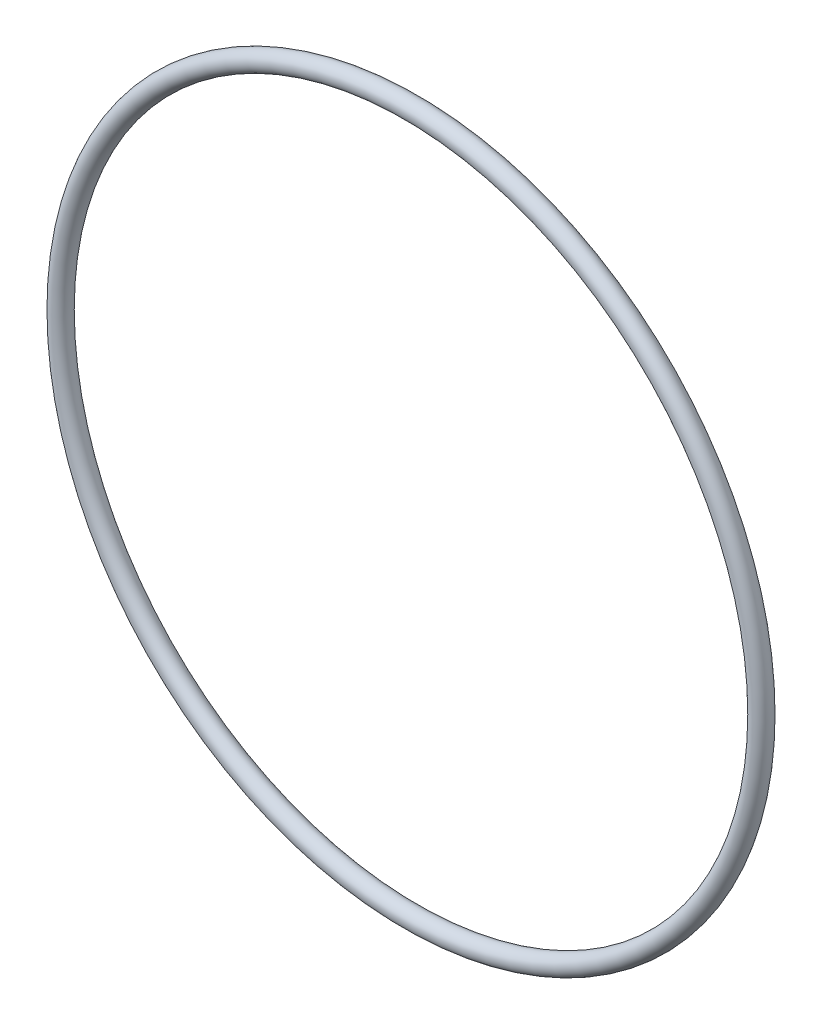
ISO-10303-21;
HEADER;
FILE_DESCRIPTION(('STEP AP214'),'2;1');
FILE_NAME('part.step','',(''),(''),'','','');
FILE_SCHEMA(('AUTOMOTIVE_DESIGN { 1 0 10303 214 1 1 1 1 }'));
ENDSEC;
DATA;
#1=APPLICATION_CONTEXT('core data for automotive mechanical design processes');
#2=APPLICATION_PROTOCOL_DEFINITION('international standard','automotive_design',2000,#1);
#3=PRODUCT_CONTEXT('',#1,'mechanical');
#4=PRODUCT('Part','Part','',(#3));
#5=PRODUCT_RELATED_PRODUCT_CATEGORY('part','',(#4));
#6=PRODUCT_DEFINITION_FORMATION('','',#4);
#7=PRODUCT_DEFINITION_CONTEXT('part definition',#1,'design');
#8=PRODUCT_DEFINITION('design','',#6,#7);
#9=PRODUCT_DEFINITION_SHAPE('','',#8);
#10=(LENGTH_UNIT() NAMED_UNIT(*) SI_UNIT(.MILLI.,.METRE.));
#11=(NAMED_UNIT(*) PLANE_ANGLE_UNIT() SI_UNIT($,.RADIAN.));
#12=(NAMED_UNIT(*) SI_UNIT($,.STERADIAN.) SOLID_ANGLE_UNIT());
#13=UNCERTAINTY_MEASURE_WITH_UNIT(LENGTH_MEASURE(1.E-05),#10,'distance_accuracy_value','');
#14=(GEOMETRIC_REPRESENTATION_CONTEXT(3) GLOBAL_UNCERTAINTY_ASSIGNED_CONTEXT((#13)) GLOBAL_UNIT_ASSIGNED_CONTEXT((#10,
#11,#12)) REPRESENTATION_CONTEXT('',''));
#15=CARTESIAN_POINT('',(0.,0.,0.));
#16=DIRECTION('',(0.,0.,1.));
#17=DIRECTION('',(1.,0.,0.));
#18=AXIS2_PLACEMENT_3D('',#15,#16,#17);
#19=CARTESIAN_POINT('',(0.,0.,0.));
#20=DIRECTION('',(0.,0.,-1.));
#21=DIRECTION('',(-1.,0.,0.));
#22=AXIS2_PLACEMENT_3D('',#19,#20,#21);
#23=TOROIDAL_SURFACE('',#22,56.25,1.55);
#24=CARTESIAN_POINT('',(-57.8,0.,0.));
#25=VERTEX_POINT('',#24);
#26=VERTEX_LOOP('',#25);
#27=FACE_BOUND('',#26,.T.);
#28=ADVANCED_FACE('F27',(#27),#23,.T.);
#29=CLOSED_SHELL('',(#28));
#30=MANIFOLD_SOLID_BREP('B2',#29);
#31=ADVANCED_BREP_SHAPE_REPRESENTATION('',(#18,#30),#14);
#32=SHAPE_DEFINITION_REPRESENTATION(#9,#31);
ENDSEC;
END-ISO-10303-21;
